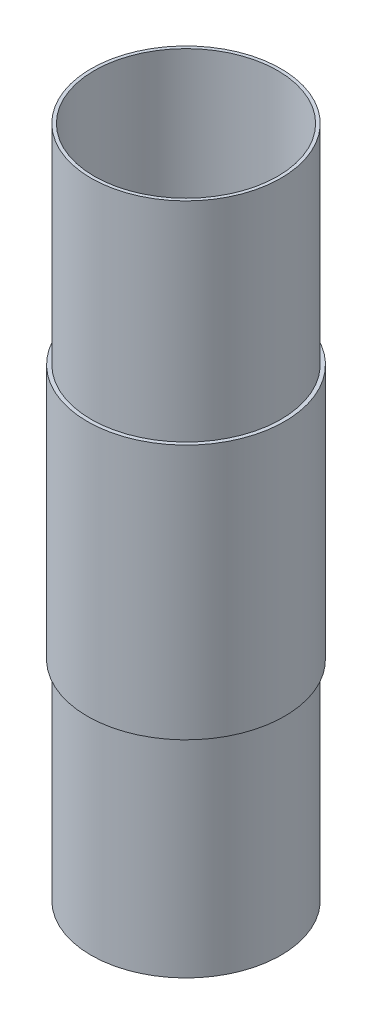
ISO-10303-21;
HEADER;
FILE_DESCRIPTION(('STEP AP214'),'2;1');
FILE_NAME('part.step','',(''),(''),'','','');
FILE_SCHEMA(('AUTOMOTIVE_DESIGN { 1 0 10303 214 1 1 1 1 }'));
ENDSEC;
DATA;
#1=APPLICATION_CONTEXT('core data for automotive mechanical design processes');
#2=APPLICATION_PROTOCOL_DEFINITION('international standard','automotive_design',2000,#1);
#3=PRODUCT_CONTEXT('',#1,'mechanical');
#4=PRODUCT('Part','Part','',(#3));
#5=PRODUCT_RELATED_PRODUCT_CATEGORY('part','',(#4));
#6=PRODUCT_DEFINITION_FORMATION('','',#4);
#7=PRODUCT_DEFINITION_CONTEXT('part definition',#1,'design');
#8=PRODUCT_DEFINITION('design','',#6,#7);
#9=PRODUCT_DEFINITION_SHAPE('','',#8);
#10=(LENGTH_UNIT() NAMED_UNIT(*) SI_UNIT(.MILLI.,.METRE.));
#11=(NAMED_UNIT(*) PLANE_ANGLE_UNIT() SI_UNIT($,.RADIAN.));
#12=(NAMED_UNIT(*) SI_UNIT($,.STERADIAN.) SOLID_ANGLE_UNIT());
#13=UNCERTAINTY_MEASURE_WITH_UNIT(LENGTH_MEASURE(1.E-05),#10,'distance_accuracy_value','');
#14=(GEOMETRIC_REPRESENTATION_CONTEXT(3) GLOBAL_UNCERTAINTY_ASSIGNED_CONTEXT((#13)) GLOBAL_UNIT_ASSIGNED_CONTEXT((#10,
#11,#12)) REPRESENTATION_CONTEXT('',''));
#15=CARTESIAN_POINT('',(0.,0.,0.));
#16=DIRECTION('',(0.,0.,1.));
#17=DIRECTION('',(1.,0.,0.));
#18=AXIS2_PLACEMENT_3D('',#15,#16,#17);
#19=CARTESIAN_POINT('',(0.,145.,0.));
#20=DIRECTION('',(0.,-1.,0.));
#21=DIRECTION('',(0.,0.,-1.));
#22=AXIS2_PLACEMENT_3D('',#19,#20,#21);
#23=CYLINDRICAL_SURFACE('',#22,40.9);
#24=CARTESIAN_POINT('',(0.,-145.,0.));
#25=DIRECTION('',(0.,1.,0.));
#26=DIRECTION('',(0.,0.,1.));
#27=AXIS2_PLACEMENT_3D('',#24,#25,#26);
#28=CIRCLE('',#27,40.9);
#29=CARTESIAN_POINT('',(0.,-145.,40.9));
#30=VERTEX_POINT('',#29);
#31=EDGE_CURVE('E52',#30,#30,#28,.T.);
#32=ORIENTED_EDGE('',*,*,#31,.T.);
#33=EDGE_LOOP('',(#32));
#34=FACE_BOUND('',#33,.T.);
#35=CARTESIAN_POINT('',(0.,-55.,0.));
#36=DIRECTION('',(0.,1.,0.));
#37=DIRECTION('',(0.,0.,1.));
#38=AXIS2_PLACEMENT_3D('',#35,#36,#37);
#39=CIRCLE('',#38,40.9);
#40=CARTESIAN_POINT('',(0.,-55.,40.9));
#41=VERTEX_POINT('',#40);
#42=EDGE_CURVE('E10',#41,#41,#39,.T.);
#43=ORIENTED_EDGE('',*,*,#42,.F.);
#44=EDGE_LOOP('',(#43));
#45=FACE_BOUND('',#44,.T.);
#46=ADVANCED_FACE('F36',(#34,#45),#23,.T.);
#47=CARTESIAN_POINT('',(0.,145.,0.));
#48=DIRECTION('',(0.,-1.,0.));
#49=DIRECTION('',(0.,0.,-1.));
#50=AXIS2_PLACEMENT_3D('',#47,#48,#49);
#51=CYLINDRICAL_SURFACE('',#50,39.5);
#52=CARTESIAN_POINT('',(0.,145.,0.));
#53=DIRECTION('',(0.,1.,0.));
#54=DIRECTION('',(0.,0.,1.));
#55=AXIS2_PLACEMENT_3D('',#52,#53,#54);
#56=CIRCLE('',#55,39.5);
#57=CARTESIAN_POINT('',(0.,145.,39.5));
#58=VERTEX_POINT('',#57);
#59=EDGE_CURVE('E47',#58,#58,#56,.T.);
#60=ORIENTED_EDGE('',*,*,#59,.T.);
#61=EDGE_LOOP('',(#60));
#62=FACE_BOUND('',#61,.T.);
#63=CARTESIAN_POINT('',(0.,-145.,0.));
#64=DIRECTION('',(0.,1.,0.));
#65=DIRECTION('',(0.,0.,1.));
#66=AXIS2_PLACEMENT_3D('',#63,#64,#65);
#67=CIRCLE('',#66,39.5);
#68=CARTESIAN_POINT('',(0.,-145.,39.5));
#69=VERTEX_POINT('',#68);
#70=EDGE_CURVE('E56',#69,#69,#67,.T.);
#71=ORIENTED_EDGE('',*,*,#70,.F.);
#72=EDGE_LOOP('',(#71));
#73=FACE_BOUND('',#72,.T.);
#74=ADVANCED_FACE('F38',(#62,#73),#51,.F.);
#75=CARTESIAN_POINT('',(0.,55.,0.));
#76=DIRECTION('',(0.,1.,0.));
#77=DIRECTION('',(0.,0.,1.));
#78=AXIS2_PLACEMENT_3D('',#75,#76,#77);
#79=CIRCLE('',#78,40.9);
#80=CARTESIAN_POINT('',(0.,55.,40.9));
#81=VERTEX_POINT('',#80);
#82=EDGE_CURVE('E92',#81,#81,#79,.T.);
#83=ORIENTED_EDGE('',*,*,#82,.T.);
#84=EDGE_LOOP('',(#83));
#85=FACE_BOUND('',#84,.T.);
#86=CARTESIAN_POINT('',(0.,145.,0.));
#87=DIRECTION('',(0.,1.,0.));
#88=DIRECTION('',(0.,0.,1.));
#89=AXIS2_PLACEMENT_3D('',#86,#87,#88);
#90=CIRCLE('',#89,40.9);
#91=CARTESIAN_POINT('',(0.,145.,40.9));
#92=VERTEX_POINT('',#91);
#93=EDGE_CURVE('E43',#92,#92,#90,.T.);
#94=ORIENTED_EDGE('',*,*,#93,.F.);
#95=EDGE_LOOP('',(#94));
#96=FACE_BOUND('',#95,.T.);
#97=ADVANCED_FACE('F77',(#85,#96),#23,.T.);
#98=CARTESIAN_POINT('',(0.,145.,0.));
#99=DIRECTION('',(0.,1.,0.));
#100=DIRECTION('',(0.,0.,1.));
#101=AXIS2_PLACEMENT_3D('',#98,#99,#100);
#102=PLANE('',#101);
#103=ORIENTED_EDGE('',*,*,#59,.F.);
#104=EDGE_LOOP('',(#103));
#105=FACE_BOUND('',#104,.T.);
#106=ORIENTED_EDGE('',*,*,#93,.T.);
#107=EDGE_LOOP('',(#106));
#108=FACE_BOUND('',#107,.T.);
#109=ADVANCED_FACE('F67',(#105,#108),#102,.T.);
#110=CARTESIAN_POINT('',(0.,-145.,0.));
#111=DIRECTION('',(0.,1.,0.));
#112=DIRECTION('',(0.,0.,1.));
#113=AXIS2_PLACEMENT_3D('',#110,#111,#112);
#114=PLANE('',#113);
#115=ORIENTED_EDGE('',*,*,#70,.T.);
#116=EDGE_LOOP('',(#115));
#117=FACE_BOUND('',#116,.T.);
#118=ORIENTED_EDGE('',*,*,#31,.F.);
#119=EDGE_LOOP('',(#118));
#120=FACE_BOUND('',#119,.T.);
#121=ADVANCED_FACE('F64',(#117,#120),#114,.F.);
#122=CARTESIAN_POINT('',(0.,55.,0.));
#123=DIRECTION('',(0.,-1.,0.));
#124=DIRECTION('',(0.,0.,-1.));
#125=AXIS2_PLACEMENT_3D('',#122,#123,#124);
#126=CYLINDRICAL_SURFACE('',#125,42.5);
#127=CARTESIAN_POINT('',(0.,55.,0.));
#128=DIRECTION('',(0.,1.,0.));
#129=DIRECTION('',(0.,0.,1.));
#130=AXIS2_PLACEMENT_3D('',#127,#128,#129);
#131=CIRCLE('',#130,42.5);
#132=CARTESIAN_POINT('',(0.,55.,42.5));
#133=VERTEX_POINT('',#132);
#134=EDGE_CURVE('E58',#133,#133,#131,.T.);
#135=ORIENTED_EDGE('',*,*,#134,.F.);
#136=EDGE_LOOP('',(#135));
#137=FACE_BOUND('',#136,.T.);
#138=CARTESIAN_POINT('',(0.,-55.,0.));
#139=DIRECTION('',(0.,1.,0.));
#140=DIRECTION('',(0.,0.,1.));
#141=AXIS2_PLACEMENT_3D('',#138,#139,#140);
#142=CIRCLE('',#141,42.5);
#143=CARTESIAN_POINT('',(0.,-55.,42.5));
#144=VERTEX_POINT('',#143);
#145=EDGE_CURVE('E94',#144,#144,#142,.T.);
#146=ORIENTED_EDGE('',*,*,#145,.T.);
#147=EDGE_LOOP('',(#146));
#148=FACE_BOUND('',#147,.T.);
#149=ADVANCED_FACE('F66',(#137,#148),#126,.T.);
#150=CARTESIAN_POINT('',(0.,55.,0.));
#151=DIRECTION('',(0.,1.,0.));
#152=DIRECTION('',(0.,0.,1.));
#153=AXIS2_PLACEMENT_3D('',#150,#151,#152);
#154=PLANE('',#153);
#155=ORIENTED_EDGE('',*,*,#82,.F.);
#156=EDGE_LOOP('',(#155));
#157=FACE_BOUND('',#156,.T.);
#158=ORIENTED_EDGE('',*,*,#134,.T.);
#159=EDGE_LOOP('',(#158));
#160=FACE_BOUND('',#159,.T.);
#161=ADVANCED_FACE('F74',(#157,#160),#154,.T.);
#162=CARTESIAN_POINT('',(0.,-55.,0.));
#163=DIRECTION('',(0.,1.,0.));
#164=DIRECTION('',(0.,0.,1.));
#165=AXIS2_PLACEMENT_3D('',#162,#163,#164);
#166=PLANE('',#165);
#167=ORIENTED_EDGE('',*,*,#42,.T.);
#168=EDGE_LOOP('',(#167));
#169=FACE_BOUND('',#168,.T.);
#170=ORIENTED_EDGE('',*,*,#145,.F.);
#171=EDGE_LOOP('',(#170));
#172=FACE_BOUND('',#171,.T.);
#173=ADVANCED_FACE('F102',(#169,#172),#166,.F.);
#174=CLOSED_SHELL('',(#46,#74,#97,#109,#121,#149,#161,#173));
#175=MANIFOLD_SOLID_BREP('B2',#174);
#176=ADVANCED_BREP_SHAPE_REPRESENTATION('',(#18,#175),#14);
#177=SHAPE_DEFINITION_REPRESENTATION(#9,#176);
ENDSEC;
END-ISO-10303-21;
